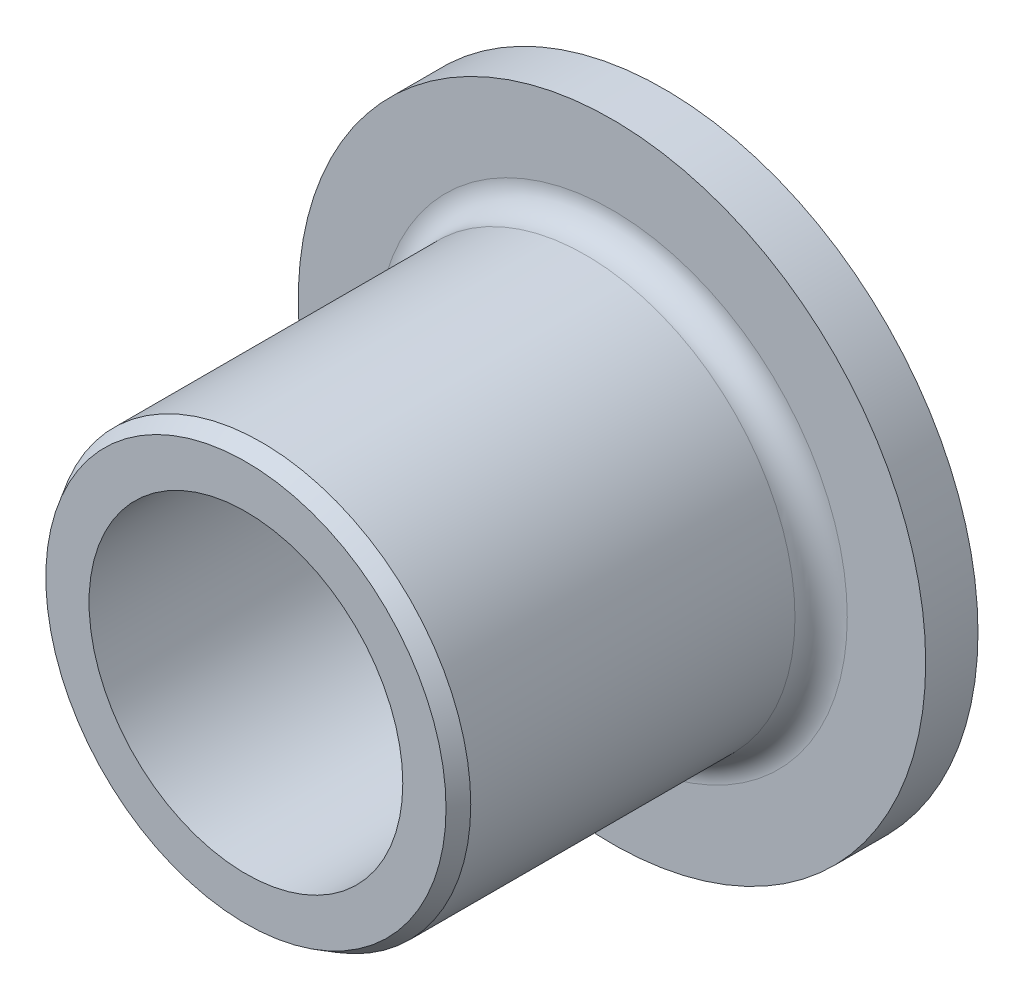
ISO-10303-21;
HEADER;
FILE_DESCRIPTION(('STEP AP214'),'2;1');
FILE_NAME('part.step','',(''),(''),'','','');
FILE_SCHEMA(('AUTOMOTIVE_DESIGN { 1 0 10303 214 1 1 1 1 }'));
ENDSEC;
DATA;
#1=APPLICATION_CONTEXT('core data for automotive mechanical design processes');
#2=APPLICATION_PROTOCOL_DEFINITION('international standard','automotive_design',2000,#1);
#3=PRODUCT_CONTEXT('',#1,'mechanical');
#4=PRODUCT('Part','Part','',(#3));
#5=PRODUCT_RELATED_PRODUCT_CATEGORY('part','',(#4));
#6=PRODUCT_DEFINITION_FORMATION('','',#4);
#7=PRODUCT_DEFINITION_CONTEXT('part definition',#1,'design');
#8=PRODUCT_DEFINITION('design','',#6,#7);
#9=PRODUCT_DEFINITION_SHAPE('','',#8);
#10=(LENGTH_UNIT() NAMED_UNIT(*) SI_UNIT(.MILLI.,.METRE.));
#11=(NAMED_UNIT(*) PLANE_ANGLE_UNIT() SI_UNIT($,.RADIAN.));
#12=(NAMED_UNIT(*) SI_UNIT($,.STERADIAN.) SOLID_ANGLE_UNIT());
#13=UNCERTAINTY_MEASURE_WITH_UNIT(LENGTH_MEASURE(1.E-05),#10,'distance_accuracy_value','');
#14=(GEOMETRIC_REPRESENTATION_CONTEXT(3) GLOBAL_UNCERTAINTY_ASSIGNED_CONTEXT((#13)) GLOBAL_UNIT_ASSIGNED_CONTEXT((#10,
#11,#12)) REPRESENTATION_CONTEXT('',''));
#15=CARTESIAN_POINT('',(0.,0.,0.));
#16=DIRECTION('',(0.,0.,1.));
#17=DIRECTION('',(1.,0.,0.));
#18=AXIS2_PLACEMENT_3D('',#15,#16,#17);
#19=CARTESIAN_POINT('',(0.,3.,0.));
#20=DIRECTION('',(0.,0.,1.));
#21=DIRECTION('',(1.,0.,0.));
#22=AXIS2_PLACEMENT_3D('',#19,#20,#21);
#23=PLANE('',#22);
#24=CARTESIAN_POINT('',(0.,0.,0.));
#25=DIRECTION('',(0.,0.,1.));
#26=DIRECTION('',(1.,0.,0.));
#27=AXIS2_PLACEMENT_3D('',#24,#25,#26);
#28=CIRCLE('',#27,6.);
#29=CARTESIAN_POINT('',(6.,0.,0.));
#30=VERTEX_POINT('',#29);
#31=EDGE_CURVE('E10',#30,#30,#28,.T.);
#32=ORIENTED_EDGE('',*,*,#31,.F.);
#33=EDGE_LOOP('',(#32));
#34=FACE_BOUND('',#33,.T.);
#35=CARTESIAN_POINT('',(0.,0.,0.));
#36=DIRECTION('',(0.,0.,1.));
#37=DIRECTION('',(1.,0.,0.));
#38=AXIS2_PLACEMENT_3D('',#35,#36,#37);
#39=CIRCLE('',#38,3.);
#40=CARTESIAN_POINT('',(3.,0.,0.));
#41=VERTEX_POINT('',#40);
#42=EDGE_CURVE('E58',#41,#41,#39,.T.);
#43=ORIENTED_EDGE('',*,*,#42,.T.);
#44=EDGE_LOOP('',(#43));
#45=FACE_BOUND('',#44,.T.);
#46=ADVANCED_FACE('F30',(#34,#45),#23,.F.);
#47=CARTESIAN_POINT('',(0.,0.,0.));
#48=DIRECTION('',(0.,0.,1.));
#49=DIRECTION('',(1.,0.,0.));
#50=AXIS2_PLACEMENT_3D('',#47,#48,#49);
#51=CYLINDRICAL_SURFACE('',#50,6.);
#52=CARTESIAN_POINT('',(0.,0.,1.));
#53=DIRECTION('',(0.,0.,1.));
#54=DIRECTION('',(1.,0.,0.));
#55=AXIS2_PLACEMENT_3D('',#52,#53,#54);
#56=CIRCLE('',#55,6.);
#57=CARTESIAN_POINT('',(6.,0.,1.));
#58=VERTEX_POINT('',#57);
#59=EDGE_CURVE('E36',#58,#58,#56,.T.);
#60=ORIENTED_EDGE('',*,*,#59,.F.);
#61=EDGE_LOOP('',(#60));
#62=FACE_BOUND('',#61,.T.);
#63=ORIENTED_EDGE('',*,*,#31,.T.);
#64=EDGE_LOOP('',(#63));
#65=FACE_BOUND('',#64,.T.);
#66=ADVANCED_FACE('F95',(#62,#65),#51,.T.);
#67=CARTESIAN_POINT('',(0.,6.,1.));
#68=DIRECTION('',(0.,0.,-1.));
#69=DIRECTION('',(-1.,0.,0.));
#70=AXIS2_PLACEMENT_3D('',#67,#68,#69);
#71=PLANE('',#70);
#72=CARTESIAN_POINT('',(0.,0.,1.));
#73=DIRECTION('',(0.,0.,1.));
#74=DIRECTION('',(1.,0.,0.));
#75=AXIS2_PLACEMENT_3D('',#72,#73,#74);
#76=CIRCLE('',#75,4.50000000000355);
#77=CARTESIAN_POINT('',(4.50000000000355,0.,1.));
#78=VERTEX_POINT('',#77);
#79=EDGE_CURVE('E40',#78,#78,#76,.T.);
#80=ORIENTED_EDGE('',*,*,#79,.F.);
#81=EDGE_LOOP('',(#80));
#82=FACE_BOUND('',#81,.T.);
#83=ORIENTED_EDGE('',*,*,#59,.T.);
#84=EDGE_LOOP('',(#83));
#85=FACE_BOUND('',#84,.T.);
#86=ADVANCED_FACE('F90',(#82,#85),#71,.F.);
#87=CARTESIAN_POINT('',(0.,0.,1.5));
#88=DIRECTION('',(0.,0.,1.));
#89=DIRECTION('',(1.,0.,0.));
#90=AXIS2_PLACEMENT_3D('',#87,#88,#89);
#91=TOROIDAL_SURFACE('',#90,4.50000000000355,0.500000000000001);
#92=CARTESIAN_POINT('',(0.,0.,1.5));
#93=DIRECTION('',(0.,0.,1.));
#94=DIRECTION('',(1.,0.,0.));
#95=AXIS2_PLACEMENT_3D('',#92,#93,#94);
#96=CIRCLE('',#95,4.00000000000354);
#97=CARTESIAN_POINT('',(4.00000000000354,0.,1.5));
#98=VERTEX_POINT('',#97);
#99=EDGE_CURVE('E44',#98,#98,#96,.T.);
#100=ORIENTED_EDGE('',*,*,#99,.F.);
#101=EDGE_LOOP('',(#100));
#102=FACE_BOUND('',#101,.T.);
#103=ORIENTED_EDGE('',*,*,#79,.T.);
#104=EDGE_LOOP('',(#103));
#105=FACE_BOUND('',#104,.T.);
#106=ADVANCED_FACE('F84',(#102,#105),#91,.F.);
#107=CARTESIAN_POINT('',(0.,0.,0.));
#108=DIRECTION('',(0.,0.,1.));
#109=DIRECTION('',(1.,0.,0.));
#110=AXIS2_PLACEMENT_3D('',#107,#108,#109);
#111=CYLINDRICAL_SURFACE('',#110,4.00000000000354);
#112=CARTESIAN_POINT('',(0.,0.,7.69999999995264));
#113=DIRECTION('',(0.,0.,1.));
#114=DIRECTION('',(1.,0.,0.));
#115=AXIS2_PLACEMENT_3D('',#112,#113,#114);
#116=CIRCLE('',#115,4.00000000000354);
#117=CARTESIAN_POINT('',(4.00000000000354,0.,7.69999999995264));
#118=VERTEX_POINT('',#117);
#119=EDGE_CURVE('E49',#118,#118,#116,.T.);
#120=ORIENTED_EDGE('',*,*,#119,.F.);
#121=EDGE_LOOP('',(#120));
#122=FACE_BOUND('',#121,.T.);
#123=ORIENTED_EDGE('',*,*,#99,.T.);
#124=EDGE_LOOP('',(#123));
#125=FACE_BOUND('',#124,.T.);
#126=ADVANCED_FACE('F78',(#122,#125),#111,.T.);
#127=CARTESIAN_POINT('',(0.,0.,7.69999999995264));
#128=DIRECTION('',(0.,0.,-1.));
#129=DIRECTION('',(-1.,0.,0.));
#130=AXIS2_PLACEMENT_3D('',#127,#128,#129);
#131=CONICAL_SURFACE('',#130,4.00000000000354,0.523598775598298);
#132=CARTESIAN_POINT('',(0.,0.,8.));
#133=DIRECTION('',(0.,0.,1.));
#134=DIRECTION('',(1.,0.,0.));
#135=AXIS2_PLACEMENT_3D('',#132,#133,#134);
#136=CIRCLE('',#135,3.82679491921931);
#137=CARTESIAN_POINT('',(3.82679491921931,0.,8.));
#138=VERTEX_POINT('',#137);
#139=EDGE_CURVE('E52',#138,#138,#136,.T.);
#140=ORIENTED_EDGE('',*,*,#139,.F.);
#141=EDGE_LOOP('',(#140));
#142=FACE_BOUND('',#141,.T.);
#143=ORIENTED_EDGE('',*,*,#119,.T.);
#144=EDGE_LOOP('',(#143));
#145=FACE_BOUND('',#144,.T.);
#146=ADVANCED_FACE('F72',(#142,#145),#131,.T.);
#147=CARTESIAN_POINT('',(0.,3.82679491921931,8.));
#148=DIRECTION('',(0.,0.,-1.));
#149=DIRECTION('',(-1.,0.,0.));
#150=AXIS2_PLACEMENT_3D('',#147,#148,#149);
#151=PLANE('',#150);
#152=CARTESIAN_POINT('',(0.,0.,8.));
#153=DIRECTION('',(0.,0.,1.));
#154=DIRECTION('',(1.,0.,0.));
#155=AXIS2_PLACEMENT_3D('',#152,#153,#154);
#156=CIRCLE('',#155,3.);
#157=CARTESIAN_POINT('',(3.,0.,8.));
#158=VERTEX_POINT('',#157);
#159=EDGE_CURVE('E55',#158,#158,#156,.T.);
#160=ORIENTED_EDGE('',*,*,#159,.F.);
#161=EDGE_LOOP('',(#160));
#162=FACE_BOUND('',#161,.T.);
#163=ORIENTED_EDGE('',*,*,#139,.T.);
#164=EDGE_LOOP('',(#163));
#165=FACE_BOUND('',#164,.T.);
#166=ADVANCED_FACE('F66',(#162,#165),#151,.F.);
#167=CARTESIAN_POINT('',(0.,0.,0.));
#168=DIRECTION('',(0.,0.,1.));
#169=DIRECTION('',(1.,0.,0.));
#170=AXIS2_PLACEMENT_3D('',#167,#168,#169);
#171=CYLINDRICAL_SURFACE('',#170,3.);
#172=ORIENTED_EDGE('',*,*,#42,.F.);
#173=EDGE_LOOP('',(#172));
#174=FACE_BOUND('',#173,.T.);
#175=ORIENTED_EDGE('',*,*,#159,.T.);
#176=EDGE_LOOP('',(#175));
#177=FACE_BOUND('',#176,.T.);
#178=ADVANCED_FACE('F63',(#174,#177),#171,.F.);
#179=CLOSED_SHELL('',(#46,#66,#86,#106,#126,#146,#166,#178));
#180=MANIFOLD_SOLID_BREP('B2',#179);
#181=ADVANCED_BREP_SHAPE_REPRESENTATION('',(#18,#180),#14);
#182=SHAPE_DEFINITION_REPRESENTATION(#9,#181);
ENDSEC;
END-ISO-10303-21;
